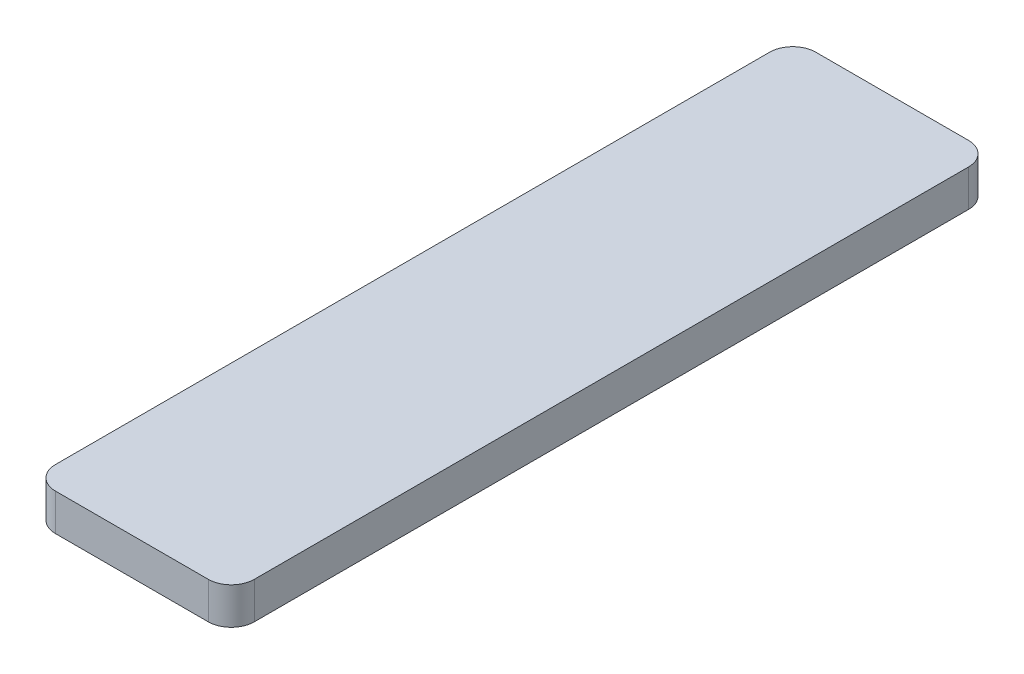
ISO-10303-21;
HEADER;
FILE_DESCRIPTION(('STEP AP214'),'2;1');
FILE_NAME('part.step','',(''),(''),'','','');
FILE_SCHEMA(('AUTOMOTIVE_DESIGN { 1 0 10303 214 1 1 1 1 }'));
ENDSEC;
DATA;
#1=APPLICATION_CONTEXT('core data for automotive mechanical design processes');
#2=APPLICATION_PROTOCOL_DEFINITION('international standard','automotive_design',2000,#1);
#3=PRODUCT_CONTEXT('',#1,'mechanical');
#4=PRODUCT('Part','Part','',(#3));
#5=PRODUCT_RELATED_PRODUCT_CATEGORY('part','',(#4));
#6=PRODUCT_DEFINITION_FORMATION('','',#4);
#7=PRODUCT_DEFINITION_CONTEXT('part definition',#1,'design');
#8=PRODUCT_DEFINITION('design','',#6,#7);
#9=PRODUCT_DEFINITION_SHAPE('','',#8);
#10=(LENGTH_UNIT() NAMED_UNIT(*) SI_UNIT(.MILLI.,.METRE.));
#11=(NAMED_UNIT(*) PLANE_ANGLE_UNIT() SI_UNIT($,.RADIAN.));
#12=(NAMED_UNIT(*) SI_UNIT($,.STERADIAN.) SOLID_ANGLE_UNIT());
#13=UNCERTAINTY_MEASURE_WITH_UNIT(LENGTH_MEASURE(1.E-05),#10,'distance_accuracy_value','');
#14=(GEOMETRIC_REPRESENTATION_CONTEXT(3) GLOBAL_UNCERTAINTY_ASSIGNED_CONTEXT((#13)) GLOBAL_UNIT_ASSIGNED_CONTEXT((#10,
#11,#12)) REPRESENTATION_CONTEXT('',''));
#15=CARTESIAN_POINT('',(0.,0.,0.));
#16=DIRECTION('',(0.,0.,1.));
#17=DIRECTION('',(1.,0.,0.));
#18=AXIS2_PLACEMENT_3D('',#15,#16,#17);
#19=CARTESIAN_POINT('',(-95.8788774366805,1.6,16.0471381404292));
#20=DIRECTION('',(-1.,0.,0.));
#21=DIRECTION('',(0.,0.,1.));
#22=AXIS2_PLACEMENT_3D('',#19,#20,#21);
#23=PLANE('',#22);
#24=DIRECTION('',(0.,0.,-1.));
#25=VECTOR('',#24,1.);
#26=CARTESIAN_POINT('',(-95.8788774366805,0.,16.0471381404292));
#27=LINE('',#26,#25);
#28=CARTESIAN_POINT('',(-95.8788774366805,0.,48.0671381404292));
#29=VERTEX_POINT('',#28);
#30=CARTESIAN_POINT('',(-95.8788774366805,0.,17.0471381404292));
#31=VERTEX_POINT('',#30);
#32=EDGE_CURVE('E127',#29,#31,#27,.T.);
#33=ORIENTED_EDGE('',*,*,#32,.T.);
#34=DIRECTION('',(0.,-1.,0.));
#35=VECTOR('',#34,1.);
#36=CARTESIAN_POINT('',(-95.8788774366805,1.6,17.0471381404292));
#37=LINE('',#36,#35);
#38=CARTESIAN_POINT('',(-95.8788774366805,1.6,17.0471381404292));
#39=VERTEX_POINT('',#38);
#40=EDGE_CURVE('E150',#31,#39,#37,.F.);
#41=ORIENTED_EDGE('',*,*,#40,.T.);
#42=DIRECTION('',(0.,0.,-1.));
#43=VECTOR('',#42,1.);
#44=CARTESIAN_POINT('',(-95.8788774366805,1.6,16.0471381404292));
#45=LINE('',#44,#43);
#46=CARTESIAN_POINT('',(-95.8788774366805,1.6,48.0671381404292));
#47=VERTEX_POINT('',#46);
#48=EDGE_CURVE('E125',#47,#39,#45,.T.);
#49=ORIENTED_EDGE('',*,*,#48,.F.);
#50=DIRECTION('',(0.,-1.,0.));
#51=VECTOR('',#50,1.);
#52=CARTESIAN_POINT('',(-95.8788774366805,1.6,48.0671381404292));
#53=LINE('',#52,#51);
#54=EDGE_CURVE('E147',#47,#29,#53,.T.);
#55=ORIENTED_EDGE('',*,*,#54,.T.);
#56=EDGE_LOOP('',(#33,#41,#49,#55));
#57=FACE_BOUND('',#56,.T.);
#58=ADVANCED_FACE('F32',(#57),#23,.F.);
#59=CARTESIAN_POINT('',(-104.51487743668,1.6,16.0471381404292));
#60=DIRECTION('',(0.,0.,1.));
#61=DIRECTION('',(1.,0.,0.));
#62=AXIS2_PLACEMENT_3D('',#59,#60,#61);
#63=PLANE('',#62);
#64=DIRECTION('',(-1.,0.,0.));
#65=VECTOR('',#64,1.);
#66=CARTESIAN_POINT('',(-104.51487743668,0.,16.0471381404292));
#67=LINE('',#66,#65);
#68=CARTESIAN_POINT('',(-96.8788774366805,0.,16.0471381404292));
#69=VERTEX_POINT('',#68);
#70=CARTESIAN_POINT('',(-103.51487743668,0.,16.0471381404292));
#71=VERTEX_POINT('',#70);
#72=EDGE_CURVE('E123',#69,#71,#67,.T.);
#73=ORIENTED_EDGE('',*,*,#72,.T.);
#74=DIRECTION('',(0.,-1.,0.));
#75=VECTOR('',#74,1.);
#76=CARTESIAN_POINT('',(-103.51487743668,1.6,16.0471381404292));
#77=LINE('',#76,#75);
#78=CARTESIAN_POINT('',(-103.51487743668,1.6,16.0471381404292));
#79=VERTEX_POINT('',#78);
#80=EDGE_CURVE('E102',#71,#79,#77,.F.);
#81=ORIENTED_EDGE('',*,*,#80,.T.);
#82=DIRECTION('',(-1.,0.,0.));
#83=VECTOR('',#82,1.);
#84=CARTESIAN_POINT('',(-104.51487743668,1.6,16.0471381404292));
#85=LINE('',#84,#83);
#86=CARTESIAN_POINT('',(-96.8788774366805,1.6,16.0471381404292));
#87=VERTEX_POINT('',#86);
#88=EDGE_CURVE('E166',#87,#79,#85,.T.);
#89=ORIENTED_EDGE('',*,*,#88,.F.);
#90=DIRECTION('',(0.,-1.,0.));
#91=VECTOR('',#90,1.);
#92=CARTESIAN_POINT('',(-96.8788774366805,1.6,16.0471381404292));
#93=LINE('',#92,#91);
#94=EDGE_CURVE('E107',#87,#69,#93,.T.);
#95=ORIENTED_EDGE('',*,*,#94,.T.);
#96=EDGE_LOOP('',(#73,#81,#89,#95));
#97=FACE_BOUND('',#96,.T.);
#98=ADVANCED_FACE('F183',(#97),#63,.F.);
#99=CARTESIAN_POINT('',(-104.51487743668,1.6,49.0671381404292));
#100=DIRECTION('',(1.,0.,0.));
#101=DIRECTION('',(0.,0.,-1.));
#102=AXIS2_PLACEMENT_3D('',#99,#100,#101);
#103=PLANE('',#102);
#104=DIRECTION('',(0.,0.,1.));
#105=VECTOR('',#104,1.);
#106=CARTESIAN_POINT('',(-104.51487743668,1.6,49.0671381404292));
#107=LINE('',#106,#105);
#108=CARTESIAN_POINT('',(-104.51487743668,1.6,17.0471381404292));
#109=VERTEX_POINT('',#108);
#110=CARTESIAN_POINT('',(-104.51487743668,1.6,48.0671381404292));
#111=VERTEX_POINT('',#110);
#112=EDGE_CURVE('E116',#109,#111,#107,.T.);
#113=ORIENTED_EDGE('',*,*,#112,.F.);
#114=DIRECTION('',(0.,-1.,0.));
#115=VECTOR('',#114,1.);
#116=CARTESIAN_POINT('',(-104.51487743668,1.6,17.0471381404292));
#117=LINE('',#116,#115);
#118=CARTESIAN_POINT('',(-104.51487743668,0.,17.0471381404292));
#119=VERTEX_POINT('',#118);
#120=EDGE_CURVE('E101',#109,#119,#117,.T.);
#121=ORIENTED_EDGE('',*,*,#120,.T.);
#122=DIRECTION('',(0.,0.,1.));
#123=VECTOR('',#122,1.);
#124=CARTESIAN_POINT('',(-104.51487743668,0.,49.0671381404292));
#125=LINE('',#124,#123);
#126=CARTESIAN_POINT('',(-104.51487743668,0.,48.0671381404292));
#127=VERTEX_POINT('',#126);
#128=EDGE_CURVE('E114',#119,#127,#125,.T.);
#129=ORIENTED_EDGE('',*,*,#128,.T.);
#130=DIRECTION('',(0.,-1.,0.));
#131=VECTOR('',#130,1.);
#132=CARTESIAN_POINT('',(-104.51487743668,1.6,48.0671381404292));
#133=LINE('',#132,#131);
#134=EDGE_CURVE('E118',#127,#111,#133,.F.);
#135=ORIENTED_EDGE('',*,*,#134,.T.);
#136=EDGE_LOOP('',(#113,#121,#129,#135));
#137=FACE_BOUND('',#136,.T.);
#138=ADVANCED_FACE('F113',(#137),#103,.F.);
#139=CARTESIAN_POINT('',(-104.51487743668,1.6,49.0671381404292));
#140=DIRECTION('',(0.,0.,-1.));
#141=DIRECTION('',(-1.,0.,0.));
#142=AXIS2_PLACEMENT_3D('',#139,#140,#141);
#143=PLANE('',#142);
#144=DIRECTION('',(1.,0.,0.));
#145=VECTOR('',#144,1.);
#146=CARTESIAN_POINT('',(-104.51487743668,0.,49.0671381404292));
#147=LINE('',#146,#145);
#148=CARTESIAN_POINT('',(-103.51487743668,0.,49.0671381404292));
#149=VERTEX_POINT('',#148);
#150=CARTESIAN_POINT('',(-96.8788774366805,0.,49.0671381404292));
#151=VERTEX_POINT('',#150);
#152=EDGE_CURVE('E122',#149,#151,#147,.T.);
#153=ORIENTED_EDGE('',*,*,#152,.T.);
#154=DIRECTION('',(0.,-1.,0.));
#155=VECTOR('',#154,1.);
#156=CARTESIAN_POINT('',(-96.8788774366805,1.6,49.0671381404292));
#157=LINE('',#156,#155);
#158=CARTESIAN_POINT('',(-96.8788774366805,1.6,49.0671381404292));
#159=VERTEX_POINT('',#158);
#160=EDGE_CURVE('E11',#151,#159,#157,.F.);
#161=ORIENTED_EDGE('',*,*,#160,.T.);
#162=DIRECTION('',(1.,0.,0.));
#163=VECTOR('',#162,1.);
#164=CARTESIAN_POINT('',(-104.51487743668,1.6,49.0671381404292));
#165=LINE('',#164,#163);
#166=CARTESIAN_POINT('',(-103.51487743668,1.6,49.0671381404292));
#167=VERTEX_POINT('',#166);
#168=EDGE_CURVE('E131',#167,#159,#165,.T.);
#169=ORIENTED_EDGE('',*,*,#168,.F.);
#170=DIRECTION('',(0.,-1.,0.));
#171=VECTOR('',#170,1.);
#172=CARTESIAN_POINT('',(-103.51487743668,1.6,49.0671381404292));
#173=LINE('',#172,#171);
#174=EDGE_CURVE('E40',#167,#149,#173,.T.);
#175=ORIENTED_EDGE('',*,*,#174,.T.);
#176=EDGE_LOOP('',(#153,#161,#169,#175));
#177=FACE_BOUND('',#176,.T.);
#178=ADVANCED_FACE('F153',(#177),#143,.F.);
#179=CARTESIAN_POINT('',(0.,1.6,0.));
#180=DIRECTION('',(0.,1.,0.));
#181=DIRECTION('',(0.,0.,1.));
#182=AXIS2_PLACEMENT_3D('',#179,#180,#181);
#183=PLANE('',#182);
#184=ORIENTED_EDGE('',*,*,#88,.T.);
#185=CARTESIAN_POINT('',(-103.51487743668,1.6,17.0471381404292));
#186=DIRECTION('',(0.,1.,0.));
#187=DIRECTION('',(0.,0.,1.));
#188=AXIS2_PLACEMENT_3D('',#185,#186,#187);
#189=CIRCLE('',#188,1.);
#190=EDGE_CURVE('E145',#79,#109,#189,.T.);
#191=ORIENTED_EDGE('',*,*,#190,.T.);
#192=ORIENTED_EDGE('',*,*,#112,.T.);
#193=CARTESIAN_POINT('',(-103.51487743668,1.6,48.0671381404292));
#194=DIRECTION('',(0.,1.,0.));
#195=DIRECTION('',(0.,0.,1.));
#196=AXIS2_PLACEMENT_3D('',#193,#194,#195);
#197=CIRCLE('',#196,1.);
#198=EDGE_CURVE('E52',#111,#167,#197,.T.);
#199=ORIENTED_EDGE('',*,*,#198,.T.);
#200=ORIENTED_EDGE('',*,*,#168,.T.);
#201=CARTESIAN_POINT('',(-96.8788774366805,1.6,48.0671381404292));
#202=DIRECTION('',(0.,1.,0.));
#203=DIRECTION('',(0.,0.,1.));
#204=AXIS2_PLACEMENT_3D('',#201,#202,#203);
#205=CIRCLE('',#204,1.);
#206=EDGE_CURVE('E141',#159,#47,#205,.T.);
#207=ORIENTED_EDGE('',*,*,#206,.T.);
#208=ORIENTED_EDGE('',*,*,#48,.T.);
#209=CARTESIAN_POINT('',(-96.8788774366805,1.6,17.0471381404292));
#210=DIRECTION('',(0.,1.,0.));
#211=DIRECTION('',(0.,0.,1.));
#212=AXIS2_PLACEMENT_3D('',#209,#210,#211);
#213=CIRCLE('',#212,1.);
#214=EDGE_CURVE('E143',#39,#87,#213,.T.);
#215=ORIENTED_EDGE('',*,*,#214,.T.);
#216=EDGE_LOOP('',(#184,#191,#192,#199,#200,#207,#208,#215));
#217=FACE_BOUND('',#216,.T.);
#218=ADVANCED_FACE('F172',(#217),#183,.T.);
#219=CARTESIAN_POINT('',(0.,0.,0.));
#220=DIRECTION('',(0.,1.,0.));
#221=DIRECTION('',(0.,0.,1.));
#222=AXIS2_PLACEMENT_3D('',#219,#220,#221);
#223=PLANE('',#222);
#224=ORIENTED_EDGE('',*,*,#128,.F.);
#225=CARTESIAN_POINT('',(-103.51487743668,0.,17.0471381404292));
#226=DIRECTION('',(0.,1.,0.));
#227=DIRECTION('',(0.,0.,1.));
#228=AXIS2_PLACEMENT_3D('',#225,#226,#227);
#229=CIRCLE('',#228,1.);
#230=EDGE_CURVE('E97',#119,#71,#229,.F.);
#231=ORIENTED_EDGE('',*,*,#230,.T.);
#232=ORIENTED_EDGE('',*,*,#72,.F.);
#233=CARTESIAN_POINT('',(-96.8788774366805,0.,17.0471381404292));
#234=DIRECTION('',(0.,1.,0.));
#235=DIRECTION('',(0.,0.,1.));
#236=AXIS2_PLACEMENT_3D('',#233,#234,#235);
#237=CIRCLE('',#236,1.);
#238=EDGE_CURVE('E108',#69,#31,#237,.F.);
#239=ORIENTED_EDGE('',*,*,#238,.T.);
#240=ORIENTED_EDGE('',*,*,#32,.F.);
#241=CARTESIAN_POINT('',(-96.8788774366805,0.,48.0671381404292));
#242=DIRECTION('',(0.,1.,0.));
#243=DIRECTION('',(0.,0.,1.));
#244=AXIS2_PLACEMENT_3D('',#241,#242,#243);
#245=CIRCLE('',#244,1.);
#246=EDGE_CURVE('E134',#29,#151,#245,.F.);
#247=ORIENTED_EDGE('',*,*,#246,.T.);
#248=ORIENTED_EDGE('',*,*,#152,.F.);
#249=CARTESIAN_POINT('',(-103.51487743668,0.,48.0671381404292));
#250=DIRECTION('',(0.,1.,0.));
#251=DIRECTION('',(0.,0.,1.));
#252=AXIS2_PLACEMENT_3D('',#249,#250,#251);
#253=CIRCLE('',#252,1.);
#254=EDGE_CURVE('E117',#149,#127,#253,.F.);
#255=ORIENTED_EDGE('',*,*,#254,.T.);
#256=EDGE_LOOP('',(#224,#231,#232,#239,#240,#247,#248,#255));
#257=FACE_BOUND('',#256,.T.);
#258=ADVANCED_FACE('F120',(#257),#223,.F.);
#259=CARTESIAN_POINT('',(-103.51487743668,1.6,17.0471381404292));
#260=DIRECTION('',(0.,-1.,0.));
#261=DIRECTION('',(0.,0.,-1.));
#262=AXIS2_PLACEMENT_3D('',#259,#260,#261);
#263=CYLINDRICAL_SURFACE('',#262,1.);
#264=ORIENTED_EDGE('',*,*,#190,.F.);
#265=ORIENTED_EDGE('',*,*,#80,.F.);
#266=ORIENTED_EDGE('',*,*,#230,.F.);
#267=ORIENTED_EDGE('',*,*,#120,.F.);
#268=EDGE_LOOP('',(#264,#265,#266,#267));
#269=FACE_BOUND('',#268,.T.);
#270=ADVANCED_FACE('F100',(#269),#263,.T.);
#271=CARTESIAN_POINT('',(-96.8788774366805,1.6,17.0471381404292));
#272=DIRECTION('',(0.,-1.,0.));
#273=DIRECTION('',(0.,0.,-1.));
#274=AXIS2_PLACEMENT_3D('',#271,#272,#273);
#275=CYLINDRICAL_SURFACE('',#274,1.);
#276=ORIENTED_EDGE('',*,*,#214,.F.);
#277=ORIENTED_EDGE('',*,*,#40,.F.);
#278=ORIENTED_EDGE('',*,*,#238,.F.);
#279=ORIENTED_EDGE('',*,*,#94,.F.);
#280=EDGE_LOOP('',(#276,#277,#278,#279));
#281=FACE_BOUND('',#280,.T.);
#282=ADVANCED_FACE('F194',(#281),#275,.T.);
#283=CARTESIAN_POINT('',(-96.8788774366805,1.6,48.0671381404292));
#284=DIRECTION('',(0.,-1.,0.));
#285=DIRECTION('',(0.,0.,-1.));
#286=AXIS2_PLACEMENT_3D('',#283,#284,#285);
#287=CYLINDRICAL_SURFACE('',#286,1.);
#288=ORIENTED_EDGE('',*,*,#206,.F.);
#289=ORIENTED_EDGE('',*,*,#160,.F.);
#290=ORIENTED_EDGE('',*,*,#246,.F.);
#291=ORIENTED_EDGE('',*,*,#54,.F.);
#292=EDGE_LOOP('',(#288,#289,#290,#291));
#293=FACE_BOUND('',#292,.T.);
#294=ADVANCED_FACE('F160',(#293),#287,.T.);
#295=CARTESIAN_POINT('',(-103.51487743668,1.6,48.0671381404292));
#296=DIRECTION('',(0.,-1.,0.));
#297=DIRECTION('',(0.,0.,-1.));
#298=AXIS2_PLACEMENT_3D('',#295,#296,#297);
#299=CYLINDRICAL_SURFACE('',#298,1.);
#300=ORIENTED_EDGE('',*,*,#198,.F.);
#301=ORIENTED_EDGE('',*,*,#134,.F.);
#302=ORIENTED_EDGE('',*,*,#254,.F.);
#303=ORIENTED_EDGE('',*,*,#174,.F.);
#304=EDGE_LOOP('',(#300,#301,#302,#303));
#305=FACE_BOUND('',#304,.T.);
#306=ADVANCED_FACE('F34',(#305),#299,.T.);
#307=CLOSED_SHELL('',(#58,#98,#138,#178,#218,#258,#270,#282,#294,#306));
#308=MANIFOLD_SOLID_BREP('B2',#307);
#309=ADVANCED_BREP_SHAPE_REPRESENTATION('',(#18,#308),#14);
#310=SHAPE_DEFINITION_REPRESENTATION(#9,#309);
ENDSEC;
END-ISO-10303-21;
